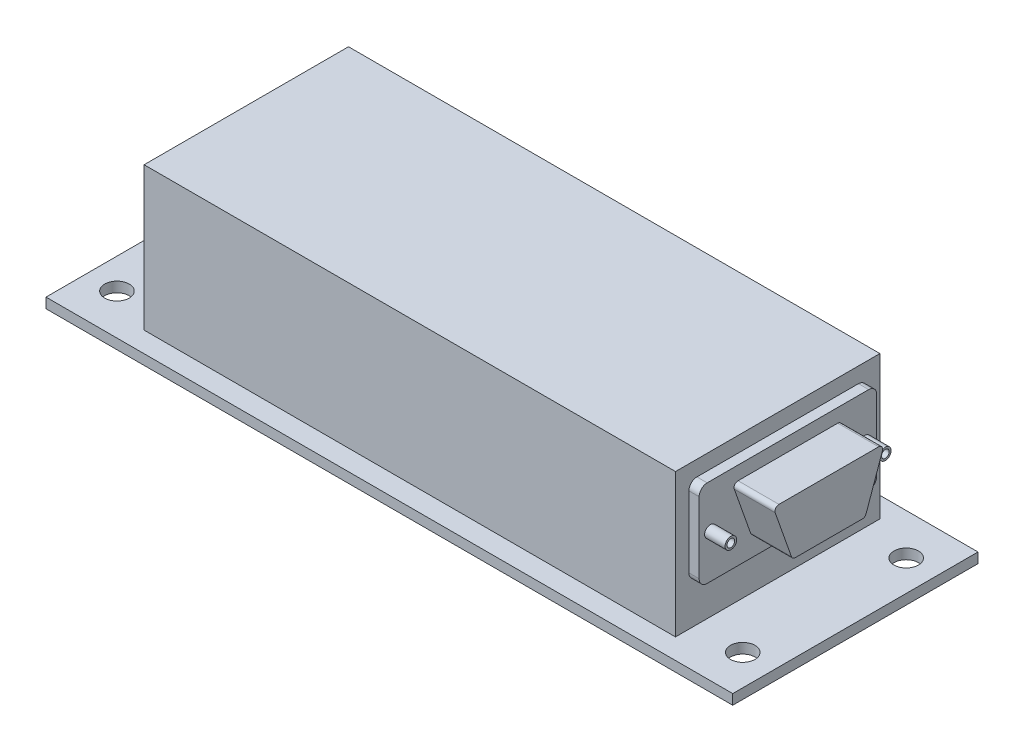
ISO-10303-21;
HEADER;
FILE_DESCRIPTION(('STEP AP214'),'2;1');
FILE_NAME('part.step','',(''),(''),'','','');
FILE_SCHEMA(('AUTOMOTIVE_DESIGN { 1 0 10303 214 1 1 1 1 }'));
ENDSEC;
DATA;
#1=APPLICATION_CONTEXT('core data for automotive mechanical design processes');
#2=APPLICATION_PROTOCOL_DEFINITION('international standard','automotive_design',2000,#1);
#3=PRODUCT_CONTEXT('',#1,'mechanical');
#4=PRODUCT('Part','Part','',(#3));
#5=PRODUCT_RELATED_PRODUCT_CATEGORY('part','',(#4));
#6=PRODUCT_DEFINITION_FORMATION('','',#4);
#7=PRODUCT_DEFINITION_CONTEXT('part definition',#1,'design');
#8=PRODUCT_DEFINITION('design','',#6,#7);
#9=PRODUCT_DEFINITION_SHAPE('','',#8);
#10=(LENGTH_UNIT() NAMED_UNIT(*) SI_UNIT(.MILLI.,.METRE.));
#11=(NAMED_UNIT(*) PLANE_ANGLE_UNIT() SI_UNIT($,.RADIAN.));
#12=(NAMED_UNIT(*) SI_UNIT($,.STERADIAN.) SOLID_ANGLE_UNIT());
#13=UNCERTAINTY_MEASURE_WITH_UNIT(LENGTH_MEASURE(1.E-05),#10,'distance_accuracy_value','');
#14=(GEOMETRIC_REPRESENTATION_CONTEXT(3) GLOBAL_UNCERTAINTY_ASSIGNED_CONTEXT((#13)) GLOBAL_UNIT_ASSIGNED_CONTEXT((#10,
#11,#12)) REPRESENTATION_CONTEXT('',''));
#15=CARTESIAN_POINT('',(0.,0.,0.));
#16=DIRECTION('',(0.,0.,1.));
#17=DIRECTION('',(1.,0.,0.));
#18=AXIS2_PLACEMENT_3D('',#15,#16,#17);
#19=CARTESIAN_POINT('',(42.8625,18.6102106849233,12.5431947926229));
#20=DIRECTION('',(-1.,0.,0.));
#21=DIRECTION('',(0.,0.,1.));
#22=AXIS2_PLACEMENT_3D('',#19,#20,#21);
#23=PLANE('',#22);
#24=CARTESIAN_POINT('',(42.8625,18.6102106849233,12.5431947926229));
#25=DIRECTION('',(-1.,0.,0.));
#26=DIRECTION('',(0.,0.,1.));
#27=AXIS2_PLACEMENT_3D('',#24,#25,#26);
#28=CIRCLE('',#27,1.25);
#29=CARTESIAN_POINT('',(42.8625,18.6102106849233,13.7931947926229));
#30=VERTEX_POINT('',#29);
#31=CARTESIAN_POINT('',(42.8625,19.8602106849233,12.5431947926229));
#32=VERTEX_POINT('',#31);
#33=EDGE_CURVE('E239',#30,#32,#28,.T.);
#34=ORIENTED_EDGE('',*,*,#33,.F.);
#35=DIRECTION('',(0.,1.,0.));
#36=VECTOR('',#35,1.);
#37=CARTESIAN_POINT('',(42.8625,7.57674864324256,13.7931947926229));
#38=LINE('',#37,#36);
#39=CARTESIAN_POINT('',(42.8625,7.57674864324256,13.7931947926229));
#40=VERTEX_POINT('',#39);
#41=EDGE_CURVE('E258',#40,#30,#38,.T.);
#42=ORIENTED_EDGE('',*,*,#41,.F.);
#43=CARTESIAN_POINT('',(42.8625,7.57674864324255,12.5431947926229));
#44=DIRECTION('',(1.,0.,0.));
#45=DIRECTION('',(0.,0.,-1.));
#46=AXIS2_PLACEMENT_3D('',#43,#44,#45);
#47=CIRCLE('',#46,1.25);
#48=CARTESIAN_POINT('',(42.8625,6.32674864324255,12.5431947926229));
#49=VERTEX_POINT('',#48);
#50=EDGE_CURVE('E256',#40,#49,#47,.T.);
#51=ORIENTED_EDGE('',*,*,#50,.T.);
#52=DIRECTION('',(0.,0.,-1.));
#53=VECTOR('',#52,1.);
#54=CARTESIAN_POINT('',(42.8625,6.32674864324255,12.5431947926229));
#55=LINE('',#54,#53);
#56=CARTESIAN_POINT('',(42.8625,6.32674864324255,-12.5431947926229));
#57=VERTEX_POINT('',#56);
#58=EDGE_CURVE('E254',#49,#57,#55,.T.);
#59=ORIENTED_EDGE('',*,*,#58,.T.);
#60=CARTESIAN_POINT('',(42.8625,7.57674864324255,-12.5431947926229));
#61=DIRECTION('',(-1.,0.,0.));
#62=DIRECTION('',(0.,0.,1.));
#63=AXIS2_PLACEMENT_3D('',#60,#61,#62);
#64=CIRCLE('',#63,1.25);
#65=CARTESIAN_POINT('',(42.8625,7.57674864324256,-13.7931947926229));
#66=VERTEX_POINT('',#65);
#67=EDGE_CURVE('E251',#66,#57,#64,.T.);
#68=ORIENTED_EDGE('',*,*,#67,.F.);
#69=DIRECTION('',(0.,1.,0.));
#70=VECTOR('',#69,1.);
#71=CARTESIAN_POINT('',(42.8625,7.57674864324256,-13.7931947926229));
#72=LINE('',#71,#70);
#73=CARTESIAN_POINT('',(42.8625,18.6102106849233,-13.7931947926229));
#74=VERTEX_POINT('',#73);
#75=EDGE_CURVE('E249',#66,#74,#72,.T.);
#76=ORIENTED_EDGE('',*,*,#75,.T.);
#77=CARTESIAN_POINT('',(42.8625,18.6102106849233,-12.5431947926229));
#78=DIRECTION('',(-1.,0.,0.));
#79=DIRECTION('',(0.,0.,1.));
#80=AXIS2_PLACEMENT_3D('',#77,#78,#79);
#81=CIRCLE('',#80,1.25);
#82=CARTESIAN_POINT('',(42.8625,19.8602106849233,-12.5431947926229));
#83=VERTEX_POINT('',#82);
#84=EDGE_CURVE('E246',#83,#74,#81,.T.);
#85=ORIENTED_EDGE('',*,*,#84,.F.);
#86=DIRECTION('',(0.,0.,-1.));
#87=VECTOR('',#86,1.);
#88=CARTESIAN_POINT('',(42.8625,19.8602106849233,12.5431947926229));
#89=LINE('',#88,#87);
#90=EDGE_CURVE('E242',#32,#83,#89,.T.);
#91=ORIENTED_EDGE('',*,*,#90,.F.);
#92=EDGE_LOOP('',(#34,#42,#51,#59,#68,#76,#85,#91));
#93=FACE_BOUND('',#92,.T.);
#94=CARTESIAN_POINT('',(42.8625,13.0934796640829,-11.9612683563152));
#95=DIRECTION('',(-1.,0.,0.));
#96=DIRECTION('',(0.,0.,1.));
#97=AXIS2_PLACEMENT_3D('',#94,#95,#96);
#98=CIRCLE('',#97,0.9);
#99=CARTESIAN_POINT('',(42.8625,13.0934796640829,-11.0612683563152));
#100=VERTEX_POINT('',#99);
#101=EDGE_CURVE('E41',#100,#100,#98,.F.);
#102=ORIENTED_EDGE('',*,*,#101,.F.);
#103=EDGE_LOOP('',(#102));
#104=FACE_BOUND('',#103,.T.);
#105=CARTESIAN_POINT('',(42.8625,13.0934796640829,12.0387316436848));
#106=DIRECTION('',(-1.,0.,0.));
#107=DIRECTION('',(0.,0.,1.));
#108=AXIS2_PLACEMENT_3D('',#105,#106,#107);
#109=CIRCLE('',#108,0.9);
#110=CARTESIAN_POINT('',(42.8625,13.0934796640829,12.9387316436848));
#111=VERTEX_POINT('',#110);
#112=EDGE_CURVE('E11',#111,#111,#109,.F.);
#113=ORIENTED_EDGE('',*,*,#112,.F.);
#114=EDGE_LOOP('',(#113));
#115=FACE_BOUND('',#114,.T.);
#116=CARTESIAN_POINT('',(42.8625,9.92592052013265,5.20764379571065));
#117=DIRECTION('',(1.,0.,0.));
#118=DIRECTION('',(0.,0.,1.));
#119=AXIS2_PLACEMENT_3D('',#116,#117,#118);
#120=CIRCLE('',#119,0.625000000000001);
#121=CARTESIAN_POINT('',(42.8625,9.71808052103222,5.79707363443103));
#122=VERTEX_POINT('',#121);
#123=CARTESIAN_POINT('',(42.8625,9.30092052013265,5.20764379571065));
#124=VERTEX_POINT('',#123);
#125=EDGE_CURVE('E214',#122,#124,#120,.T.);
#126=ORIENTED_EDGE('',*,*,#125,.F.);
#127=DIRECTION('',(0.,-0.943087741952607,-0.33254399856069));
#128=VECTOR('',#127,1.);
#129=CARTESIAN_POINT('',(42.8625,16.9065080909268,8.33179902753954));
#130=LINE('',#129,#128);
#131=CARTESIAN_POINT('',(42.8625,16.9065080909268,8.33179902753954));
#132=VERTEX_POINT('',#131);
#133=EDGE_CURVE('E211',#132,#122,#130,.T.);
#134=ORIENTED_EDGE('',*,*,#133,.F.);
#135=CARTESIAN_POINT('',(42.8625,17.1143480900272,7.74236918881916));
#136=DIRECTION('',(1.,0.,0.));
#137=DIRECTION('',(0.,0.,1.));
#138=AXIS2_PLACEMENT_3D('',#135,#136,#137);
#139=CIRCLE('',#138,0.625);
#140=CARTESIAN_POINT('',(42.8625,17.7393480900272,7.74236918881913));
#141=VERTEX_POINT('',#140);
#142=EDGE_CURVE('E410',#141,#132,#139,.T.);
#143=ORIENTED_EDGE('',*,*,#142,.F.);
#144=DIRECTION('',(0.,0.,1.));
#145=VECTOR('',#144,1.);
#146=CARTESIAN_POINT('',(42.8625,17.7393480900266,-7.74236918882591));
#147=LINE('',#146,#145);
#148=CARTESIAN_POINT('',(42.8625,17.7393480900266,-7.74236918882591));
#149=VERTEX_POINT('',#148);
#150=EDGE_CURVE('E444',#149,#141,#147,.T.);
#151=ORIENTED_EDGE('',*,*,#150,.F.);
#152=CARTESIAN_POINT('',(42.8625,17.1143480900272,-7.74236918882546));
#153=DIRECTION('',(1.,0.,0.));
#154=DIRECTION('',(0.,0.,1.));
#155=AXIS2_PLACEMENT_3D('',#152,#153,#154);
#156=CIRCLE('',#155,0.625);
#157=CARTESIAN_POINT('',(42.8625,16.9065080909264,-8.33179902754568));
#158=VERTEX_POINT('',#157);
#159=EDGE_CURVE('E438',#158,#149,#156,.T.);
#160=ORIENTED_EDGE('',*,*,#159,.F.);
#161=DIRECTION('',(0.,0.943087741952335,-0.332543998561462));
#162=VECTOR('',#161,1.);
#163=CARTESIAN_POINT('',(42.8625,9.71808052103179,-5.79707363443123));
#164=LINE('',#163,#162);
#165=CARTESIAN_POINT('',(42.8625,9.71808052103179,-5.79707363443124));
#166=VERTEX_POINT('',#165);
#167=EDGE_CURVE('E433',#166,#158,#164,.T.);
#168=ORIENTED_EDGE('',*,*,#167,.F.);
#169=CARTESIAN_POINT('',(42.8625,9.92592052013265,-5.20764379571101));
#170=DIRECTION('',(1.,0.,0.));
#171=DIRECTION('',(0.,0.,1.));
#172=AXIS2_PLACEMENT_3D('',#169,#170,#171);
#173=CIRCLE('',#172,0.625);
#174=CARTESIAN_POINT('',(42.8625,9.30092052013265,-5.207643795711));
#175=VERTEX_POINT('',#174);
#176=EDGE_CURVE('E53',#175,#166,#173,.T.);
#177=ORIENTED_EDGE('',*,*,#176,.F.);
#178=DIRECTION('',(0.,0.,-1.));
#179=VECTOR('',#178,1.);
#180=CARTESIAN_POINT('',(42.8625,9.30092052013265,5.20764379571065));
#181=LINE('',#180,#179);
#182=EDGE_CURVE('E48',#124,#175,#181,.T.);
#183=ORIENTED_EDGE('',*,*,#182,.F.);
#184=EDGE_LOOP('',(#126,#134,#143,#151,#160,#168,#177,#183));
#185=FACE_BOUND('',#184,.T.);
#186=ADVANCED_FACE('F33',(#93,#104,#115,#185),#23,.F.);
#187=CARTESIAN_POINT('',(0.,0.,0.));
#188=DIRECTION('',(0.,-1.,0.));
#189=DIRECTION('',(0.,0.,-1.));
#190=AXIS2_PLACEMENT_3D('',#187,#188,#189);
#191=PLANE('',#190);
#192=DIRECTION('',(0.,0.,1.));
#193=VECTOR('',#192,1.);
#194=CARTESIAN_POINT('',(-53.34,0.,19.05));
#195=LINE('',#194,#193);
#196=CARTESIAN_POINT('',(-53.34,0.,-19.05));
#197=VERTEX_POINT('',#196);
#198=CARTESIAN_POINT('',(-53.34,0.,19.05));
#199=VERTEX_POINT('',#198);
#200=EDGE_CURVE('E355',#197,#199,#195,.T.);
#201=ORIENTED_EDGE('',*,*,#200,.T.);
#202=DIRECTION('',(1.,0.,0.));
#203=VECTOR('',#202,1.);
#204=CARTESIAN_POINT('',(-53.34,0.,19.05));
#205=LINE('',#204,#203);
#206=CARTESIAN_POINT('',(53.34,0.,19.05));
#207=VERTEX_POINT('',#206);
#208=EDGE_CURVE('E374',#199,#207,#205,.T.);
#209=ORIENTED_EDGE('',*,*,#208,.T.);
#210=DIRECTION('',(0.,0.,-1.));
#211=VECTOR('',#210,1.);
#212=CARTESIAN_POINT('',(53.34,0.,19.05));
#213=LINE('',#212,#211);
#214=CARTESIAN_POINT('',(53.34,0.,-19.05));
#215=VERTEX_POINT('',#214);
#216=EDGE_CURVE('E377',#207,#215,#213,.T.);
#217=ORIENTED_EDGE('',*,*,#216,.T.);
#218=DIRECTION('',(-1.,0.,0.));
#219=VECTOR('',#218,1.);
#220=CARTESIAN_POINT('',(-53.34,0.,-19.05));
#221=LINE('',#220,#219);
#222=EDGE_CURVE('E362',#215,#197,#221,.T.);
#223=ORIENTED_EDGE('',*,*,#222,.T.);
#224=EDGE_LOOP('',(#201,#209,#217,#223));
#225=FACE_BOUND('',#224,.T.);
#226=CARTESIAN_POINT('',(-48.6359969579293,0.,-12.6603271121407));
#227=DIRECTION('',(0.,1.,0.));
#228=DIRECTION('',(0.,0.,1.));
#229=AXIS2_PLACEMENT_3D('',#226,#227,#228);
#230=CIRCLE('',#229,1.9);
#231=CARTESIAN_POINT('',(-48.6359969579293,0.,-10.7603271121407));
#232=VERTEX_POINT('',#231);
#233=EDGE_CURVE('E343',#232,#232,#230,.T.);
#234=ORIENTED_EDGE('',*,*,#233,.F.);
#235=EDGE_LOOP('',(#234));
#236=FACE_BOUND('',#235,.T.);
#237=CARTESIAN_POINT('',(48.5774999999967,0.,12.7313045134695));
#238=DIRECTION('',(0.,1.,0.));
#239=DIRECTION('',(0.,0.,1.));
#240=AXIS2_PLACEMENT_3D('',#237,#238,#239);
#241=CIRCLE('',#240,1.9);
#242=CARTESIAN_POINT('',(48.5774999999967,0.,14.6313045134695));
#243=VERTEX_POINT('',#242);
#244=EDGE_CURVE('E333',#243,#243,#241,.T.);
#245=ORIENTED_EDGE('',*,*,#244,.F.);
#246=EDGE_LOOP('',(#245));
#247=FACE_BOUND('',#246,.T.);
#248=CARTESIAN_POINT('',(48.5775000000035,0.,-12.6603271121407));
#249=DIRECTION('',(0.,1.,0.));
#250=DIRECTION('',(0.,0.,1.));
#251=AXIS2_PLACEMENT_3D('',#248,#249,#250);
#252=CIRCLE('',#251,1.9);
#253=CARTESIAN_POINT('',(48.5775000000035,0.,-10.7603271121407));
#254=VERTEX_POINT('',#253);
#255=EDGE_CURVE('E337',#254,#254,#252,.T.);
#256=ORIENTED_EDGE('',*,*,#255,.F.);
#257=EDGE_LOOP('',(#256));
#258=FACE_BOUND('',#257,.T.);
#259=CARTESIAN_POINT('',(-48.6359969579293,0.,12.7313045134734));
#260=DIRECTION('',(0.,1.,0.));
#261=DIRECTION('',(0.,0.,1.));
#262=AXIS2_PLACEMENT_3D('',#259,#260,#261);
#263=CIRCLE('',#262,1.9);
#264=CARTESIAN_POINT('',(-48.6359969579293,0.,14.6313045134734));
#265=VERTEX_POINT('',#264);
#266=EDGE_CURVE('E344',#265,#265,#263,.T.);
#267=ORIENTED_EDGE('',*,*,#266,.F.);
#268=EDGE_LOOP('',(#267));
#269=FACE_BOUND('',#268,.T.);
#270=DIRECTION('',(0.,0.,-1.));
#271=VECTOR('',#270,1.);
#272=CARTESIAN_POINT('',(41.275,0.,15.875));
#273=LINE('',#272,#271);
#274=CARTESIAN_POINT('',(41.275,0.,15.875));
#275=VERTEX_POINT('',#274);
#276=CARTESIAN_POINT('',(41.275,0.,-15.875));
#277=VERTEX_POINT('',#276);
#278=EDGE_CURVE('E285',#275,#277,#273,.T.);
#279=ORIENTED_EDGE('',*,*,#278,.F.);
#280=DIRECTION('',(1.,0.,0.));
#281=VECTOR('',#280,1.);
#282=CARTESIAN_POINT('',(-41.275,0.,15.875));
#283=LINE('',#282,#281);
#284=CARTESIAN_POINT('',(-41.275,0.,15.875));
#285=VERTEX_POINT('',#284);
#286=EDGE_CURVE('E305',#285,#275,#283,.T.);
#287=ORIENTED_EDGE('',*,*,#286,.F.);
#288=DIRECTION('',(0.,0.,1.));
#289=VECTOR('',#288,1.);
#290=CARTESIAN_POINT('',(-41.275,0.,15.875));
#291=LINE('',#290,#289);
#292=CARTESIAN_POINT('',(-41.275,0.,-15.875));
#293=VERTEX_POINT('',#292);
#294=EDGE_CURVE('E317',#293,#285,#291,.T.);
#295=ORIENTED_EDGE('',*,*,#294,.F.);
#296=DIRECTION('',(-1.,0.,0.));
#297=VECTOR('',#296,1.);
#298=CARTESIAN_POINT('',(-41.275,0.,-15.875));
#299=LINE('',#298,#297);
#300=EDGE_CURVE('E314',#277,#293,#299,.T.);
#301=ORIENTED_EDGE('',*,*,#300,.F.);
#302=EDGE_LOOP('',(#279,#287,#295,#301));
#303=FACE_BOUND('',#302,.T.);
#304=ADVANCED_FACE('F395',(#225,#236,#247,#258,#269,#303),#191,.F.);
#305=CARTESIAN_POINT('',(-53.34,-1.5748,19.05));
#306=DIRECTION('',(-1.,0.,0.));
#307=DIRECTION('',(0.,0.,1.));
#308=AXIS2_PLACEMENT_3D('',#305,#306,#307);
#309=PLANE('',#308);
#310=ORIENTED_EDGE('',*,*,#200,.F.);
#311=DIRECTION('',(0.,1.,0.));
#312=VECTOR('',#311,1.);
#313=CARTESIAN_POINT('',(-53.34,-1.5748,-19.05));
#314=LINE('',#313,#312);
#315=CARTESIAN_POINT('',(-53.34,-1.5748,-19.05));
#316=VERTEX_POINT('',#315);
#317=EDGE_CURVE('E382',#316,#197,#314,.T.);
#318=ORIENTED_EDGE('',*,*,#317,.F.);
#319=DIRECTION('',(0.,0.,1.));
#320=VECTOR('',#319,1.);
#321=CARTESIAN_POINT('',(-53.34,-1.5748,19.05));
#322=LINE('',#321,#320);
#323=CARTESIAN_POINT('',(-53.34,-1.5748,19.05));
#324=VERTEX_POINT('',#323);
#325=EDGE_CURVE('E358',#316,#324,#322,.T.);
#326=ORIENTED_EDGE('',*,*,#325,.T.);
#327=DIRECTION('',(0.,1.,0.));
#328=VECTOR('',#327,1.);
#329=CARTESIAN_POINT('',(-53.34,-1.5748,19.05));
#330=LINE('',#329,#328);
#331=EDGE_CURVE('E371',#324,#199,#330,.T.);
#332=ORIENTED_EDGE('',*,*,#331,.T.);
#333=EDGE_LOOP('',(#310,#318,#326,#332));
#334=FACE_BOUND('',#333,.T.);
#335=ADVANCED_FACE('F35',(#334),#309,.T.);
#336=CARTESIAN_POINT('',(-53.34,-1.5748,-19.05));
#337=DIRECTION('',(0.,0.,-1.));
#338=DIRECTION('',(-1.,0.,0.));
#339=AXIS2_PLACEMENT_3D('',#336,#337,#338);
#340=PLANE('',#339);
#341=ORIENTED_EDGE('',*,*,#222,.F.);
#342=DIRECTION('',(0.,1.,0.));
#343=VECTOR('',#342,1.);
#344=CARTESIAN_POINT('',(53.34,-1.5748,-19.05));
#345=LINE('',#344,#343);
#346=CARTESIAN_POINT('',(53.34,-1.5748,-19.05));
#347=VERTEX_POINT('',#346);
#348=EDGE_CURVE('E384',#347,#215,#345,.T.);
#349=ORIENTED_EDGE('',*,*,#348,.F.);
#350=DIRECTION('',(-1.,0.,0.));
#351=VECTOR('',#350,1.);
#352=CARTESIAN_POINT('',(-53.34,-1.5748,-19.05));
#353=LINE('',#352,#351);
#354=EDGE_CURVE('E368',#347,#316,#353,.T.);
#355=ORIENTED_EDGE('',*,*,#354,.T.);
#356=ORIENTED_EDGE('',*,*,#317,.T.);
#357=EDGE_LOOP('',(#341,#349,#355,#356));
#358=FACE_BOUND('',#357,.T.);
#359=ADVANCED_FACE('F579',(#358),#340,.T.);
#360=CARTESIAN_POINT('',(53.34,-1.5748,19.05));
#361=DIRECTION('',(1.,0.,0.));
#362=DIRECTION('',(0.,0.,-1.));
#363=AXIS2_PLACEMENT_3D('',#360,#361,#362);
#364=PLANE('',#363);
#365=ORIENTED_EDGE('',*,*,#216,.F.);
#366=DIRECTION('',(0.,1.,0.));
#367=VECTOR('',#366,1.);
#368=CARTESIAN_POINT('',(53.34,-1.5748,19.05));
#369=LINE('',#368,#367);
#370=CARTESIAN_POINT('',(53.34,-1.5748,19.05));
#371=VERTEX_POINT('',#370);
#372=EDGE_CURVE('E386',#371,#207,#369,.T.);
#373=ORIENTED_EDGE('',*,*,#372,.F.);
#374=DIRECTION('',(0.,0.,-1.));
#375=VECTOR('',#374,1.);
#376=CARTESIAN_POINT('',(53.34,-1.5748,19.05));
#377=LINE('',#376,#375);
#378=EDGE_CURVE('E365',#371,#347,#377,.T.);
#379=ORIENTED_EDGE('',*,*,#378,.T.);
#380=ORIENTED_EDGE('',*,*,#348,.T.);
#381=EDGE_LOOP('',(#365,#373,#379,#380));
#382=FACE_BOUND('',#381,.T.);
#383=ADVANCED_FACE('F582',(#382),#364,.T.);
#384=CARTESIAN_POINT('',(-53.34,-1.5748,19.05));
#385=DIRECTION('',(0.,0.,1.));
#386=DIRECTION('',(1.,0.,0.));
#387=AXIS2_PLACEMENT_3D('',#384,#385,#386);
#388=PLANE('',#387);
#389=ORIENTED_EDGE('',*,*,#208,.F.);
#390=ORIENTED_EDGE('',*,*,#331,.F.);
#391=DIRECTION('',(1.,0.,0.));
#392=VECTOR('',#391,1.);
#393=CARTESIAN_POINT('',(-53.34,-1.5748,19.05));
#394=LINE('',#393,#392);
#395=EDGE_CURVE('E361',#324,#371,#394,.T.);
#396=ORIENTED_EDGE('',*,*,#395,.T.);
#397=ORIENTED_EDGE('',*,*,#372,.T.);
#398=EDGE_LOOP('',(#389,#390,#396,#397));
#399=FACE_BOUND('',#398,.T.);
#400=ADVANCED_FACE('F574',(#399),#388,.T.);
#401=CARTESIAN_POINT('',(0.,-1.5748,0.));
#402=DIRECTION('',(0.,-1.,0.));
#403=DIRECTION('',(0.,0.,-1.));
#404=AXIS2_PLACEMENT_3D('',#401,#402,#403);
#405=PLANE('',#404);
#406=CARTESIAN_POINT('',(-48.6359969579293,-1.5748,12.7313045134734));
#407=DIRECTION('',(0.,1.,0.));
#408=DIRECTION('',(0.,0.,1.));
#409=AXIS2_PLACEMENT_3D('',#406,#407,#408);
#410=CIRCLE('',#409,1.9);
#411=CARTESIAN_POINT('',(-48.6359969579293,-1.5748,14.6313045134734));
#412=VERTEX_POINT('',#411);
#413=EDGE_CURVE('E340',#412,#412,#410,.T.);
#414=ORIENTED_EDGE('',*,*,#413,.T.);
#415=EDGE_LOOP('',(#414));
#416=FACE_BOUND('',#415,.T.);
#417=CARTESIAN_POINT('',(48.5775000000035,-1.5748,-12.6603271121407));
#418=DIRECTION('',(0.,1.,0.));
#419=DIRECTION('',(0.,0.,1.));
#420=AXIS2_PLACEMENT_3D('',#417,#418,#419);
#421=CIRCLE('',#420,1.9);
#422=CARTESIAN_POINT('',(48.5775000000035,-1.5748,-10.7603271121407));
#423=VERTEX_POINT('',#422);
#424=EDGE_CURVE('E347',#423,#423,#421,.T.);
#425=ORIENTED_EDGE('',*,*,#424,.T.);
#426=EDGE_LOOP('',(#425));
#427=FACE_BOUND('',#426,.T.);
#428=CARTESIAN_POINT('',(48.5774999999967,-1.5748,12.7313045134695));
#429=DIRECTION('',(0.,1.,0.));
#430=DIRECTION('',(0.,0.,1.));
#431=AXIS2_PLACEMENT_3D('',#428,#429,#430);
#432=CIRCLE('',#431,1.9);
#433=CARTESIAN_POINT('',(48.5774999999967,-1.5748,14.6313045134695));
#434=VERTEX_POINT('',#433);
#435=EDGE_CURVE('E334',#434,#434,#432,.T.);
#436=ORIENTED_EDGE('',*,*,#435,.T.);
#437=EDGE_LOOP('',(#436));
#438=FACE_BOUND('',#437,.T.);
#439=CARTESIAN_POINT('',(-48.6359969579293,-1.5748,-12.6603271121407));
#440=DIRECTION('',(0.,1.,0.));
#441=DIRECTION('',(0.,0.,1.));
#442=AXIS2_PLACEMENT_3D('',#439,#440,#441);
#443=CIRCLE('',#442,1.9);
#444=CARTESIAN_POINT('',(-48.6359969579293,-1.5748,-10.7603271121407));
#445=VERTEX_POINT('',#444);
#446=EDGE_CURVE('E352',#445,#445,#443,.T.);
#447=ORIENTED_EDGE('',*,*,#446,.T.);
#448=EDGE_LOOP('',(#447));
#449=FACE_BOUND('',#448,.T.);
#450=ORIENTED_EDGE('',*,*,#325,.F.);
#451=ORIENTED_EDGE('',*,*,#354,.F.);
#452=ORIENTED_EDGE('',*,*,#378,.F.);
#453=ORIENTED_EDGE('',*,*,#395,.F.);
#454=EDGE_LOOP('',(#450,#451,#452,#453));
#455=FACE_BOUND('',#454,.T.);
#456=ADVANCED_FACE('F570',(#416,#427,#438,#449,#455),#405,.T.);
#457=CARTESIAN_POINT('',(-48.6359969579293,-1.5748,-12.6603271121407));
#458=DIRECTION('',(0.,1.,0.));
#459=DIRECTION('',(0.,0.,1.));
#460=AXIS2_PLACEMENT_3D('',#457,#458,#459);
#461=CYLINDRICAL_SURFACE('',#460,1.9);
#462=ORIENTED_EDGE('',*,*,#446,.F.);
#463=EDGE_LOOP('',(#462));
#464=FACE_BOUND('',#463,.T.);
#465=ORIENTED_EDGE('',*,*,#233,.T.);
#466=EDGE_LOOP('',(#465));
#467=FACE_BOUND('',#466,.T.);
#468=ADVANCED_FACE('F560',(#464,#467),#461,.F.);
#469=CARTESIAN_POINT('',(48.5774999999967,-1.5748,12.7313045134695));
#470=DIRECTION('',(0.,1.,0.));
#471=DIRECTION('',(0.,0.,1.));
#472=AXIS2_PLACEMENT_3D('',#469,#470,#471);
#473=CYLINDRICAL_SURFACE('',#472,1.9);
#474=ORIENTED_EDGE('',*,*,#435,.F.);
#475=EDGE_LOOP('',(#474));
#476=FACE_BOUND('',#475,.T.);
#477=ORIENTED_EDGE('',*,*,#244,.T.);
#478=EDGE_LOOP('',(#477));
#479=FACE_BOUND('',#478,.T.);
#480=ADVANCED_FACE('F556',(#476,#479),#473,.F.);
#481=CARTESIAN_POINT('',(48.5775000000035,-1.5748,-12.6603271121407));
#482=DIRECTION('',(0.,1.,0.));
#483=DIRECTION('',(0.,0.,1.));
#484=AXIS2_PLACEMENT_3D('',#481,#482,#483);
#485=CYLINDRICAL_SURFACE('',#484,1.9);
#486=ORIENTED_EDGE('',*,*,#424,.F.);
#487=EDGE_LOOP('',(#486));
#488=FACE_BOUND('',#487,.T.);
#489=ORIENTED_EDGE('',*,*,#255,.T.);
#490=EDGE_LOOP('',(#489));
#491=FACE_BOUND('',#490,.T.);
#492=ADVANCED_FACE('F559',(#488,#491),#485,.F.);
#493=CARTESIAN_POINT('',(-48.6359969579293,-1.5748,12.7313045134734));
#494=DIRECTION('',(0.,1.,0.));
#495=DIRECTION('',(0.,0.,1.));
#496=AXIS2_PLACEMENT_3D('',#493,#494,#495);
#497=CYLINDRICAL_SURFACE('',#496,1.9);
#498=ORIENTED_EDGE('',*,*,#413,.F.);
#499=EDGE_LOOP('',(#498));
#500=FACE_BOUND('',#499,.T.);
#501=ORIENTED_EDGE('',*,*,#266,.T.);
#502=EDGE_LOOP('',(#501));
#503=FACE_BOUND('',#502,.T.);
#504=ADVANCED_FACE('F554',(#500,#503),#497,.F.);
#505=CARTESIAN_POINT('',(41.275,22.2504,15.875));
#506=DIRECTION('',(-1.,0.,0.));
#507=DIRECTION('',(0.,0.,1.));
#508=AXIS2_PLACEMENT_3D('',#505,#506,#507);
#509=PLANE('',#508);
#510=DIRECTION('',(0.,1.,0.));
#511=VECTOR('',#510,1.);
#512=CARTESIAN_POINT('',(41.275,7.57674864324256,13.7931947926229));
#513=LINE('',#512,#511);
#514=CARTESIAN_POINT('',(41.275,7.57674864324256,13.7931947926229));
#515=VERTEX_POINT('',#514);
#516=CARTESIAN_POINT('',(41.275,18.6102106849233,13.7931947926229));
#517=VERTEX_POINT('',#516);
#518=EDGE_CURVE('E243',#515,#517,#513,.T.);
#519=ORIENTED_EDGE('',*,*,#518,.T.);
#520=CARTESIAN_POINT('',(41.275,18.6102106849233,12.5431947926229));
#521=DIRECTION('',(-1.,0.,0.));
#522=DIRECTION('',(0.,0.,1.));
#523=AXIS2_PLACEMENT_3D('',#520,#521,#522);
#524=CIRCLE('',#523,1.25);
#525=CARTESIAN_POINT('',(41.275,19.8602106849233,12.5431947926229));
#526=VERTEX_POINT('',#525);
#527=EDGE_CURVE('E238',#517,#526,#524,.T.);
#528=ORIENTED_EDGE('',*,*,#527,.T.);
#529=DIRECTION('',(0.,0.,-1.));
#530=VECTOR('',#529,1.);
#531=CARTESIAN_POINT('',(41.275,19.8602106849233,12.5431947926229));
#532=LINE('',#531,#530);
#533=CARTESIAN_POINT('',(41.275,19.8602106849233,-12.5431947926229));
#534=VERTEX_POINT('',#533);
#535=EDGE_CURVE('E264',#526,#534,#532,.T.);
#536=ORIENTED_EDGE('',*,*,#535,.T.);
#537=CARTESIAN_POINT('',(41.275,18.6102106849233,-12.5431947926229));
#538=DIRECTION('',(-1.,0.,0.));
#539=DIRECTION('',(0.,0.,1.));
#540=AXIS2_PLACEMENT_3D('',#537,#538,#539);
#541=CIRCLE('',#540,1.25);
#542=CARTESIAN_POINT('',(41.275,18.6102106849233,-13.7931947926229));
#543=VERTEX_POINT('',#542);
#544=EDGE_CURVE('E267',#534,#543,#541,.T.);
#545=ORIENTED_EDGE('',*,*,#544,.T.);
#546=DIRECTION('',(0.,1.,0.));
#547=VECTOR('',#546,1.);
#548=CARTESIAN_POINT('',(41.275,7.57674864324256,-13.7931947926229));
#549=LINE('',#548,#547);
#550=CARTESIAN_POINT('',(41.275,7.57674864324256,-13.7931947926229));
#551=VERTEX_POINT('',#550);
#552=EDGE_CURVE('E270',#551,#543,#549,.T.);
#553=ORIENTED_EDGE('',*,*,#552,.F.);
#554=CARTESIAN_POINT('',(41.275,7.57674864324255,-12.5431947926229));
#555=DIRECTION('',(-1.,0.,0.));
#556=DIRECTION('',(0.,0.,1.));
#557=AXIS2_PLACEMENT_3D('',#554,#555,#556);
#558=CIRCLE('',#557,1.25);
#559=CARTESIAN_POINT('',(41.275,6.32674864324255,-12.5431947926229));
#560=VERTEX_POINT('',#559);
#561=EDGE_CURVE('E273',#551,#560,#558,.T.);
#562=ORIENTED_EDGE('',*,*,#561,.T.);
#563=DIRECTION('',(0.,0.,-1.));
#564=VECTOR('',#563,1.);
#565=CARTESIAN_POINT('',(41.275,6.32674864324255,12.5431947926229));
#566=LINE('',#565,#564);
#567=CARTESIAN_POINT('',(41.275,6.32674864324255,12.5431947926229));
#568=VERTEX_POINT('',#567);
#569=EDGE_CURVE('E276',#568,#560,#566,.T.);
#570=ORIENTED_EDGE('',*,*,#569,.F.);
#571=CARTESIAN_POINT('',(41.275,7.57674864324255,12.5431947926229));
#572=DIRECTION('',(1.,0.,0.));
#573=DIRECTION('',(0.,0.,-1.));
#574=AXIS2_PLACEMENT_3D('',#571,#572,#573);
#575=CIRCLE('',#574,1.25);
#576=EDGE_CURVE('E279',#515,#568,#575,.T.);
#577=ORIENTED_EDGE('',*,*,#576,.F.);
#578=EDGE_LOOP('',(#519,#528,#536,#545,#553,#562,#570,#577));
#579=FACE_BOUND('',#578,.T.);
#580=ORIENTED_EDGE('',*,*,#278,.T.);
#581=DIRECTION('',(0.,-1.,0.));
#582=VECTOR('',#581,1.);
#583=CARTESIAN_POINT('',(41.275,22.2504,-15.875));
#584=LINE('',#583,#582);
#585=CARTESIAN_POINT('',(41.275,22.2504,-15.875));
#586=VERTEX_POINT('',#585);
#587=EDGE_CURVE('E330',#586,#277,#584,.T.);
#588=ORIENTED_EDGE('',*,*,#587,.F.);
#589=DIRECTION('',(0.,0.,-1.));
#590=VECTOR('',#589,1.);
#591=CARTESIAN_POINT('',(41.275,22.2504,15.875));
#592=LINE('',#591,#590);
#593=CARTESIAN_POINT('',(41.275,22.2504,15.875));
#594=VERTEX_POINT('',#593);
#595=EDGE_CURVE('E301',#594,#586,#592,.T.);
#596=ORIENTED_EDGE('',*,*,#595,.F.);
#597=DIRECTION('',(0.,-1.,0.));
#598=VECTOR('',#597,1.);
#599=CARTESIAN_POINT('',(41.275,22.2504,15.875));
#600=LINE('',#599,#598);
#601=EDGE_CURVE('E311',#594,#275,#600,.T.);
#602=ORIENTED_EDGE('',*,*,#601,.T.);
#603=EDGE_LOOP('',(#580,#588,#596,#602));
#604=FACE_BOUND('',#603,.T.);
#605=ADVANCED_FACE('F550',(#579,#604),#509,.F.);
#606=CARTESIAN_POINT('',(-41.275,22.2504,-15.875));
#607=DIRECTION('',(0.,0.,1.));
#608=DIRECTION('',(1.,0.,0.));
#609=AXIS2_PLACEMENT_3D('',#606,#607,#608);
#610=PLANE('',#609);
#611=ORIENTED_EDGE('',*,*,#300,.T.);
#612=DIRECTION('',(0.,-1.,0.));
#613=VECTOR('',#612,1.);
#614=CARTESIAN_POINT('',(-41.275,22.2504,-15.875));
#615=LINE('',#614,#613);
#616=CARTESIAN_POINT('',(-41.275,22.2504,-15.875));
#617=VERTEX_POINT('',#616);
#618=EDGE_CURVE('E327',#617,#293,#615,.T.);
#619=ORIENTED_EDGE('',*,*,#618,.F.);
#620=DIRECTION('',(-1.,0.,0.));
#621=VECTOR('',#620,1.);
#622=CARTESIAN_POINT('',(-41.275,22.2504,-15.875));
#623=LINE('',#622,#621);
#624=EDGE_CURVE('E304',#586,#617,#623,.T.);
#625=ORIENTED_EDGE('',*,*,#624,.F.);
#626=ORIENTED_EDGE('',*,*,#587,.T.);
#627=EDGE_LOOP('',(#611,#619,#625,#626));
#628=FACE_BOUND('',#627,.T.);
#629=ADVANCED_FACE('F546',(#628),#610,.F.);
#630=CARTESIAN_POINT('',(-41.275,22.2504,15.875));
#631=DIRECTION('',(1.,0.,0.));
#632=DIRECTION('',(0.,0.,-1.));
#633=AXIS2_PLACEMENT_3D('',#630,#631,#632);
#634=PLANE('',#633);
#635=ORIENTED_EDGE('',*,*,#294,.T.);
#636=DIRECTION('',(0.,-1.,0.));
#637=VECTOR('',#636,1.);
#638=CARTESIAN_POINT('',(-41.275,22.2504,15.875));
#639=LINE('',#638,#637);
#640=CARTESIAN_POINT('',(-41.275,22.2504,15.875));
#641=VERTEX_POINT('',#640);
#642=EDGE_CURVE('E324',#641,#285,#639,.T.);
#643=ORIENTED_EDGE('',*,*,#642,.F.);
#644=DIRECTION('',(0.,0.,1.));
#645=VECTOR('',#644,1.);
#646=CARTESIAN_POINT('',(-41.275,22.2504,15.875));
#647=LINE('',#646,#645);
#648=EDGE_CURVE('E307',#617,#641,#647,.T.);
#649=ORIENTED_EDGE('',*,*,#648,.F.);
#650=ORIENTED_EDGE('',*,*,#618,.T.);
#651=EDGE_LOOP('',(#635,#643,#649,#650));
#652=FACE_BOUND('',#651,.T.);
#653=ADVANCED_FACE('F542',(#652),#634,.F.);
#654=CARTESIAN_POINT('',(-41.275,22.2504,15.875));
#655=DIRECTION('',(0.,0.,-1.));
#656=DIRECTION('',(-1.,0.,0.));
#657=AXIS2_PLACEMENT_3D('',#654,#655,#656);
#658=PLANE('',#657);
#659=ORIENTED_EDGE('',*,*,#286,.T.);
#660=ORIENTED_EDGE('',*,*,#601,.F.);
#661=DIRECTION('',(1.,0.,0.));
#662=VECTOR('',#661,1.);
#663=CARTESIAN_POINT('',(-41.275,22.2504,15.875));
#664=LINE('',#663,#662);
#665=EDGE_CURVE('E309',#641,#594,#664,.T.);
#666=ORIENTED_EDGE('',*,*,#665,.F.);
#667=ORIENTED_EDGE('',*,*,#642,.T.);
#668=EDGE_LOOP('',(#659,#660,#666,#667));
#669=FACE_BOUND('',#668,.T.);
#670=ADVANCED_FACE('F538',(#669),#658,.F.);
#671=CARTESIAN_POINT('',(0.,22.2504,0.));
#672=DIRECTION('',(0.,-1.,0.));
#673=DIRECTION('',(0.,0.,-1.));
#674=AXIS2_PLACEMENT_3D('',#671,#672,#673);
#675=PLANE('',#674);
#676=ORIENTED_EDGE('',*,*,#595,.T.);
#677=ORIENTED_EDGE('',*,*,#624,.T.);
#678=ORIENTED_EDGE('',*,*,#648,.T.);
#679=ORIENTED_EDGE('',*,*,#665,.T.);
#680=EDGE_LOOP('',(#676,#677,#678,#679));
#681=FACE_BOUND('',#680,.T.);
#682=ADVANCED_FACE('F534',(#681),#675,.F.);
#683=CARTESIAN_POINT('',(42.8625,18.6102106849233,12.5431947926229));
#684=DIRECTION('',(-1.,0.,0.));
#685=DIRECTION('',(0.,0.,1.));
#686=AXIS2_PLACEMENT_3D('',#683,#684,#685);
#687=CYLINDRICAL_SURFACE('',#686,1.25);
#688=ORIENTED_EDGE('',*,*,#527,.F.);
#689=DIRECTION('',(-1.,0.,0.));
#690=VECTOR('',#689,1.);
#691=CARTESIAN_POINT('',(42.8625,18.6102106849233,13.7931947926229));
#692=LINE('',#691,#690);
#693=EDGE_CURVE('E283',#30,#517,#692,.T.);
#694=ORIENTED_EDGE('',*,*,#693,.F.);
#695=ORIENTED_EDGE('',*,*,#33,.T.);
#696=DIRECTION('',(-1.,0.,0.));
#697=VECTOR('',#696,1.);
#698=CARTESIAN_POINT('',(42.8625,19.8602106849233,12.5431947926229));
#699=LINE('',#698,#697);
#700=EDGE_CURVE('E261',#32,#526,#699,.T.);
#701=ORIENTED_EDGE('',*,*,#700,.T.);
#702=EDGE_LOOP('',(#688,#694,#695,#701));
#703=FACE_BOUND('',#702,.T.);
#704=ADVANCED_FACE('F508',(#703),#687,.T.);
#705=CARTESIAN_POINT('',(42.8625,7.57674864324256,13.7931947926229));
#706=DIRECTION('',(0.,0.,1.));
#707=DIRECTION('',(1.,0.,0.));
#708=AXIS2_PLACEMENT_3D('',#705,#706,#707);
#709=PLANE('',#708);
#710=ORIENTED_EDGE('',*,*,#518,.F.);
#711=DIRECTION('',(-1.,0.,0.));
#712=VECTOR('',#711,1.);
#713=CARTESIAN_POINT('',(42.8625,7.57674864324256,13.7931947926229));
#714=LINE('',#713,#712);
#715=EDGE_CURVE('E286',#40,#515,#714,.T.);
#716=ORIENTED_EDGE('',*,*,#715,.F.);
#717=ORIENTED_EDGE('',*,*,#41,.T.);
#718=ORIENTED_EDGE('',*,*,#693,.T.);
#719=EDGE_LOOP('',(#710,#716,#717,#718));
#720=FACE_BOUND('',#719,.T.);
#721=ADVANCED_FACE('F504',(#720),#709,.T.);
#722=CARTESIAN_POINT('',(42.8625,7.57674864324255,12.5431947926229));
#723=DIRECTION('',(-1.,0.,0.));
#724=DIRECTION('',(0.,0.,1.));
#725=AXIS2_PLACEMENT_3D('',#722,#723,#724);
#726=CYLINDRICAL_SURFACE('',#725,1.25);
#727=ORIENTED_EDGE('',*,*,#576,.T.);
#728=DIRECTION('',(-1.,0.,0.));
#729=VECTOR('',#728,1.);
#730=CARTESIAN_POINT('',(42.8625,6.32674864324255,12.5431947926229));
#731=LINE('',#730,#729);
#732=EDGE_CURVE('E288',#49,#568,#731,.T.);
#733=ORIENTED_EDGE('',*,*,#732,.F.);
#734=ORIENTED_EDGE('',*,*,#50,.F.);
#735=ORIENTED_EDGE('',*,*,#715,.T.);
#736=EDGE_LOOP('',(#727,#733,#734,#735));
#737=FACE_BOUND('',#736,.T.);
#738=ADVANCED_FACE('F507',(#737),#726,.T.);
#739=CARTESIAN_POINT('',(42.8625,6.32674864324255,12.5431947926229));
#740=DIRECTION('',(0.,1.,0.));
#741=DIRECTION('',(0.,0.,1.));
#742=AXIS2_PLACEMENT_3D('',#739,#740,#741);
#743=PLANE('',#742);
#744=ORIENTED_EDGE('',*,*,#569,.T.);
#745=DIRECTION('',(-1.,0.,0.));
#746=VECTOR('',#745,1.);
#747=CARTESIAN_POINT('',(42.8625,6.32674864324255,-12.5431947926229));
#748=LINE('',#747,#746);
#749=EDGE_CURVE('E291',#57,#560,#748,.T.);
#750=ORIENTED_EDGE('',*,*,#749,.F.);
#751=ORIENTED_EDGE('',*,*,#58,.F.);
#752=ORIENTED_EDGE('',*,*,#732,.T.);
#753=EDGE_LOOP('',(#744,#750,#751,#752));
#754=FACE_BOUND('',#753,.T.);
#755=ADVANCED_FACE('F512',(#754),#743,.F.);
#756=CARTESIAN_POINT('',(42.8625,7.57674864324255,-12.5431947926229));
#757=DIRECTION('',(-1.,0.,0.));
#758=DIRECTION('',(0.,0.,1.));
#759=AXIS2_PLACEMENT_3D('',#756,#757,#758);
#760=CYLINDRICAL_SURFACE('',#759,1.25);
#761=ORIENTED_EDGE('',*,*,#561,.F.);
#762=DIRECTION('',(-1.,0.,0.));
#763=VECTOR('',#762,1.);
#764=CARTESIAN_POINT('',(42.8625,7.57674864324256,-13.7931947926229));
#765=LINE('',#764,#763);
#766=EDGE_CURVE('E293',#66,#551,#765,.T.);
#767=ORIENTED_EDGE('',*,*,#766,.F.);
#768=ORIENTED_EDGE('',*,*,#67,.T.);
#769=ORIENTED_EDGE('',*,*,#749,.T.);
#770=EDGE_LOOP('',(#761,#767,#768,#769));
#771=FACE_BOUND('',#770,.T.);
#772=ADVANCED_FACE('F516',(#771),#760,.T.);
#773=CARTESIAN_POINT('',(42.8625,7.57674864324256,-13.7931947926229));
#774=DIRECTION('',(0.,0.,1.));
#775=DIRECTION('',(1.,0.,0.));
#776=AXIS2_PLACEMENT_3D('',#773,#774,#775);
#777=PLANE('',#776);
#778=ORIENTED_EDGE('',*,*,#552,.T.);
#779=DIRECTION('',(-1.,0.,0.));
#780=VECTOR('',#779,1.);
#781=CARTESIAN_POINT('',(42.8625,18.6102106849233,-13.7931947926229));
#782=LINE('',#781,#780);
#783=EDGE_CURVE('E295',#74,#543,#782,.T.);
#784=ORIENTED_EDGE('',*,*,#783,.F.);
#785=ORIENTED_EDGE('',*,*,#75,.F.);
#786=ORIENTED_EDGE('',*,*,#766,.T.);
#787=EDGE_LOOP('',(#778,#784,#785,#786));
#788=FACE_BOUND('',#787,.T.);
#789=ADVANCED_FACE('F520',(#788),#777,.F.);
#790=CARTESIAN_POINT('',(42.8625,18.6102106849233,-12.5431947926229));
#791=DIRECTION('',(-1.,0.,0.));
#792=DIRECTION('',(0.,0.,1.));
#793=AXIS2_PLACEMENT_3D('',#790,#791,#792);
#794=CYLINDRICAL_SURFACE('',#793,1.25);
#795=ORIENTED_EDGE('',*,*,#544,.F.);
#796=DIRECTION('',(-1.,0.,0.));
#797=VECTOR('',#796,1.);
#798=CARTESIAN_POINT('',(42.8625,19.8602106849233,-12.5431947926229));
#799=LINE('',#798,#797);
#800=EDGE_CURVE('E297',#83,#534,#799,.T.);
#801=ORIENTED_EDGE('',*,*,#800,.F.);
#802=ORIENTED_EDGE('',*,*,#84,.T.);
#803=ORIENTED_EDGE('',*,*,#783,.T.);
#804=EDGE_LOOP('',(#795,#801,#802,#803));
#805=FACE_BOUND('',#804,.T.);
#806=ADVANCED_FACE('F524',(#805),#794,.T.);
#807=CARTESIAN_POINT('',(42.8625,19.8602106849233,12.5431947926229));
#808=DIRECTION('',(0.,1.,0.));
#809=DIRECTION('',(0.,0.,1.));
#810=AXIS2_PLACEMENT_3D('',#807,#808,#809);
#811=PLANE('',#810);
#812=ORIENTED_EDGE('',*,*,#535,.F.);
#813=ORIENTED_EDGE('',*,*,#700,.F.);
#814=ORIENTED_EDGE('',*,*,#90,.T.);
#815=ORIENTED_EDGE('',*,*,#800,.T.);
#816=EDGE_LOOP('',(#812,#813,#814,#815));
#817=FACE_BOUND('',#816,.T.);
#818=ADVANCED_FACE('F499',(#817),#811,.T.);
#819=CARTESIAN_POINT('',(46.0375,13.0934796640829,-11.9612683563152));
#820=DIRECTION('',(1.,0.,0.));
#821=DIRECTION('',(0.,0.,-1.));
#822=AXIS2_PLACEMENT_3D('',#819,#820,#821);
#823=PLANE('',#822);
#824=CARTESIAN_POINT('',(46.0375,13.0934796640829,-11.9612683563152));
#825=DIRECTION('',(1.,0.,0.));
#826=DIRECTION('',(0.,0.,-1.));
#827=AXIS2_PLACEMENT_3D('',#824,#825,#826);
#828=CIRCLE('',#827,0.9);
#829=CARTESIAN_POINT('',(46.0375,13.0934796640829,-12.8612683563152));
#830=VERTEX_POINT('',#829);
#831=EDGE_CURVE('E233',#830,#830,#828,.T.);
#832=ORIENTED_EDGE('',*,*,#831,.T.);
#833=EDGE_LOOP('',(#832));
#834=FACE_BOUND('',#833,.T.);
#835=CARTESIAN_POINT('',(46.0375,13.0934796640829,-11.9612683563152));
#836=DIRECTION('',(1.,0.,0.));
#837=DIRECTION('',(0.,0.,-1.));
#838=AXIS2_PLACEMENT_3D('',#835,#836,#837);
#839=CIRCLE('',#838,0.6);
#840=CARTESIAN_POINT('',(46.0375,13.0934796640829,-12.5612683563152));
#841=VERTEX_POINT('',#840);
#842=EDGE_CURVE('E230',#841,#841,#839,.T.);
#843=ORIENTED_EDGE('',*,*,#842,.F.);
#844=EDGE_LOOP('',(#843));
#845=FACE_BOUND('',#844,.T.);
#846=ADVANCED_FACE('F496',(#834,#845),#823,.T.);
#847=CARTESIAN_POINT('',(46.0375,13.0934796640829,-11.9612683563152));
#848=DIRECTION('',(-1.,0.,0.));
#849=DIRECTION('',(0.,0.,1.));
#850=AXIS2_PLACEMENT_3D('',#847,#848,#849);
#851=CYLINDRICAL_SURFACE('',#850,0.9);
#852=ORIENTED_EDGE('',*,*,#831,.F.);
#853=EDGE_LOOP('',(#852));
#854=FACE_BOUND('',#853,.T.);
#855=ORIENTED_EDGE('',*,*,#101,.T.);
#856=EDGE_LOOP('',(#855));
#857=FACE_BOUND('',#856,.T.);
#858=ADVANCED_FACE('F391',(#854,#857),#851,.T.);
#859=CARTESIAN_POINT('',(46.0375,13.0934796640829,-11.9612683563152));
#860=DIRECTION('',(-1.,0.,0.));
#861=DIRECTION('',(0.,0.,1.));
#862=AXIS2_PLACEMENT_3D('',#859,#860,#861);
#863=CYLINDRICAL_SURFACE('',#862,0.6);
#864=ORIENTED_EDGE('',*,*,#842,.T.);
#865=EDGE_LOOP('',(#864));
#866=FACE_BOUND('',#865,.T.);
#867=CARTESIAN_POINT('',(42.8625,13.0934796640829,-11.9612683563152));
#868=DIRECTION('',(1.,0.,0.));
#869=DIRECTION('',(0.,0.,-1.));
#870=AXIS2_PLACEMENT_3D('',#867,#868,#869);
#871=CIRCLE('',#870,0.6);
#872=CARTESIAN_POINT('',(42.8625,13.0934796640829,-12.5612683563152));
#873=VERTEX_POINT('',#872);
#874=EDGE_CURVE('E229',#873,#873,#871,.T.);
#875=ORIENTED_EDGE('',*,*,#874,.F.);
#876=EDGE_LOOP('',(#875));
#877=FACE_BOUND('',#876,.T.);
#878=ADVANCED_FACE('F492',(#866,#877),#863,.F.);
#879=ORIENTED_EDGE('',*,*,#874,.T.);
#880=EDGE_LOOP('',(#879));
#881=FACE_BOUND('',#880,.T.);
#882=ADVANCED_FACE('F399',(#881),#23,.F.);
#883=CARTESIAN_POINT('',(46.0375,13.0934796640829,12.0387316436848));
#884=DIRECTION('',(1.,0.,0.));
#885=DIRECTION('',(0.,0.,-1.));
#886=AXIS2_PLACEMENT_3D('',#883,#884,#885);
#887=PLANE('',#886);
#888=CARTESIAN_POINT('',(46.0375,13.0934796640829,12.0387316436848));
#889=DIRECTION('',(1.,0.,0.));
#890=DIRECTION('',(0.,0.,-1.));
#891=AXIS2_PLACEMENT_3D('',#888,#889,#890);
#892=CIRCLE('',#891,0.9);
#893=CARTESIAN_POINT('',(46.0375,13.0934796640829,11.1387316436848));
#894=VERTEX_POINT('',#893);
#895=EDGE_CURVE('E225',#894,#894,#892,.T.);
#896=ORIENTED_EDGE('',*,*,#895,.T.);
#897=EDGE_LOOP('',(#896));
#898=FACE_BOUND('',#897,.T.);
#899=CARTESIAN_POINT('',(46.0375,13.0934796640829,12.0387316436848));
#900=DIRECTION('',(1.,0.,0.));
#901=DIRECTION('',(0.,0.,-1.));
#902=AXIS2_PLACEMENT_3D('',#899,#900,#901);
#903=CIRCLE('',#902,0.6);
#904=CARTESIAN_POINT('',(46.0375,13.0934796640829,11.4387316436848));
#905=VERTEX_POINT('',#904);
#906=EDGE_CURVE('E218',#905,#905,#903,.T.);
#907=ORIENTED_EDGE('',*,*,#906,.F.);
#908=EDGE_LOOP('',(#907));
#909=FACE_BOUND('',#908,.T.);
#910=ADVANCED_FACE('F485',(#898,#909),#887,.T.);
#911=CARTESIAN_POINT('',(46.0375,13.0934796640829,12.0387316436848));
#912=DIRECTION('',(-1.,0.,0.));
#913=DIRECTION('',(0.,0.,1.));
#914=AXIS2_PLACEMENT_3D('',#911,#912,#913);
#915=CYLINDRICAL_SURFACE('',#914,0.9);
#916=ORIENTED_EDGE('',*,*,#895,.F.);
#917=EDGE_LOOP('',(#916));
#918=FACE_BOUND('',#917,.T.);
#919=ORIENTED_EDGE('',*,*,#112,.T.);
#920=EDGE_LOOP('',(#919));
#921=FACE_BOUND('',#920,.T.);
#922=ADVANCED_FACE('F483',(#918,#921),#915,.T.);
#923=CARTESIAN_POINT('',(46.0375,13.0934796640829,12.0387316436848));
#924=DIRECTION('',(-1.,0.,0.));
#925=DIRECTION('',(0.,0.,1.));
#926=AXIS2_PLACEMENT_3D('',#923,#924,#925);
#927=CYLINDRICAL_SURFACE('',#926,0.6);
#928=ORIENTED_EDGE('',*,*,#906,.T.);
#929=EDGE_LOOP('',(#928));
#930=FACE_BOUND('',#929,.T.);
#931=CARTESIAN_POINT('',(42.8625,13.0934796640829,12.0387316436848));
#932=DIRECTION('',(1.,0.,0.));
#933=DIRECTION('',(0.,0.,-1.));
#934=AXIS2_PLACEMENT_3D('',#931,#932,#933);
#935=CIRCLE('',#934,0.6);
#936=CARTESIAN_POINT('',(42.8625,13.0934796640829,11.4387316436848));
#937=VERTEX_POINT('',#936);
#938=EDGE_CURVE('E215',#937,#937,#935,.T.);
#939=ORIENTED_EDGE('',*,*,#938,.F.);
#940=EDGE_LOOP('',(#939));
#941=FACE_BOUND('',#940,.T.);
#942=ADVANCED_FACE('F480',(#930,#941),#927,.F.);
#943=ORIENTED_EDGE('',*,*,#938,.T.);
#944=EDGE_LOOP('',(#943));
#945=FACE_BOUND('',#944,.T.);
#946=ADVANCED_FACE('F398',(#945),#23,.F.);
#947=CARTESIAN_POINT('',(49.2125,9.92592052013265,5.20764379571065));
#948=DIRECTION('',(-1.,0.,0.));
#949=DIRECTION('',(0.,0.,1.));
#950=AXIS2_PLACEMENT_3D('',#947,#948,#949);
#951=CYLINDRICAL_SURFACE('',#950,0.625000000000001);
#952=ORIENTED_EDGE('',*,*,#125,.T.);
#953=DIRECTION('',(-1.,0.,0.));
#954=VECTOR('',#953,1.);
#955=CARTESIAN_POINT('',(49.2125,9.30092052013265,5.20764379571065));
#956=LINE('',#955,#954);
#957=CARTESIAN_POINT('',(49.2125,9.30092052013265,5.20764379571065));
#958=VERTEX_POINT('',#957);
#959=EDGE_CURVE('E195',#958,#124,#956,.T.);
#960=ORIENTED_EDGE('',*,*,#959,.F.);
#961=CARTESIAN_POINT('',(49.2125,9.92592052013265,5.20764379571065));
#962=DIRECTION('',(1.,0.,0.));
#963=DIRECTION('',(0.,0.,1.));
#964=AXIS2_PLACEMENT_3D('',#961,#962,#963);
#965=CIRCLE('',#964,0.625000000000001);
#966=CARTESIAN_POINT('',(49.2125,9.71808052103222,5.79707363443103));
#967=VERTEX_POINT('',#966);
#968=EDGE_CURVE('E202',#967,#958,#965,.T.);
#969=ORIENTED_EDGE('',*,*,#968,.F.);
#970=DIRECTION('',(-1.,0.,0.));
#971=VECTOR('',#970,1.);
#972=CARTESIAN_POINT('',(49.2125,9.71808052103222,5.79707363443103));
#973=LINE('',#972,#971);
#974=EDGE_CURVE('E407',#967,#122,#973,.T.);
#975=ORIENTED_EDGE('',*,*,#974,.T.);
#976=EDGE_LOOP('',(#952,#960,#969,#975));
#977=FACE_BOUND('',#976,.T.);
#978=ADVANCED_FACE('F213',(#977),#951,.T.);
#979=CARTESIAN_POINT('',(49.2125,9.30092052013265,5.20764379571065));
#980=DIRECTION('',(0.,1.,0.));
#981=DIRECTION('',(0.,0.,1.));
#982=AXIS2_PLACEMENT_3D('',#979,#980,#981);
#983=PLANE('',#982);
#984=ORIENTED_EDGE('',*,*,#182,.T.);
#985=DIRECTION('',(-1.,0.,0.));
#986=VECTOR('',#985,1.);
#987=CARTESIAN_POINT('',(49.2125,9.30092052013265,-5.207643795711));
#988=LINE('',#987,#986);
#989=CARTESIAN_POINT('',(49.2125,9.30092052013265,-5.207643795711));
#990=VERTEX_POINT('',#989);
#991=EDGE_CURVE('E198',#990,#175,#988,.T.);
#992=ORIENTED_EDGE('',*,*,#991,.F.);
#993=DIRECTION('',(0.,0.,-1.));
#994=VECTOR('',#993,1.);
#995=CARTESIAN_POINT('',(49.2125,9.30092052013265,5.20764379571065));
#996=LINE('',#995,#994);
#997=EDGE_CURVE('E191',#958,#990,#996,.T.);
#998=ORIENTED_EDGE('',*,*,#997,.F.);
#999=ORIENTED_EDGE('',*,*,#959,.T.);
#1000=EDGE_LOOP('',(#984,#992,#998,#999));
#1001=FACE_BOUND('',#1000,.T.);
#1002=ADVANCED_FACE('F193',(#1001),#983,.F.);
#1003=CARTESIAN_POINT('',(49.2125,9.92592052013265,-5.20764379571101));
#1004=DIRECTION('',(-1.,0.,0.));
#1005=DIRECTION('',(0.,0.,1.));
#1006=AXIS2_PLACEMENT_3D('',#1003,#1004,#1005);
#1007=CYLINDRICAL_SURFACE('',#1006,0.625);
#1008=ORIENTED_EDGE('',*,*,#176,.T.);
#1009=DIRECTION('',(-1.,0.,0.));
#1010=VECTOR('',#1009,1.);
#1011=CARTESIAN_POINT('',(49.2125,9.71808052103179,-5.79707363443124));
#1012=LINE('',#1011,#1010);
#1013=CARTESIAN_POINT('',(49.2125,9.71808052103179,-5.79707363443124));
#1014=VERTEX_POINT('',#1013);
#1015=EDGE_CURVE('E220',#1014,#166,#1012,.T.);
#1016=ORIENTED_EDGE('',*,*,#1015,.F.);
#1017=CARTESIAN_POINT('',(49.2125,9.92592052013265,-5.20764379571101));
#1018=DIRECTION('',(1.,0.,0.));
#1019=DIRECTION('',(0.,0.,1.));
#1020=AXIS2_PLACEMENT_3D('',#1017,#1018,#1019);
#1021=CIRCLE('',#1020,0.625);
#1022=EDGE_CURVE('E201',#990,#1014,#1021,.T.);
#1023=ORIENTED_EDGE('',*,*,#1022,.F.);
#1024=ORIENTED_EDGE('',*,*,#991,.T.);
#1025=EDGE_LOOP('',(#1008,#1016,#1023,#1024));
#1026=FACE_BOUND('',#1025,.T.);
#1027=ADVANCED_FACE('F436',(#1026),#1007,.T.);
#1028=CARTESIAN_POINT('',(49.2125,9.71808052103179,-5.79707363443123));
#1029=DIRECTION('',(0.,0.332543998561462,0.943087741952335));
#1030=DIRECTION('',(0.,-0.943087741952335,0.332543998561462));
#1031=AXIS2_PLACEMENT_3D('',#1028,#1029,#1030);
#1032=PLANE('',#1031);
#1033=ORIENTED_EDGE('',*,*,#167,.T.);
#1034=DIRECTION('',(-1.,0.,0.));
#1035=VECTOR('',#1034,1.);
#1036=CARTESIAN_POINT('',(49.2125,16.9065080909262,-8.33179902754629));
#1037=LINE('',#1036,#1035);
#1038=CARTESIAN_POINT('',(49.2125,16.9065080909262,-8.33179902754629));
#1039=VERTEX_POINT('',#1038);
#1040=EDGE_CURVE('E424',#1039,#158,#1037,.T.);
#1041=ORIENTED_EDGE('',*,*,#1040,.F.);
#1042=DIRECTION('',(0.,0.943087741952335,-0.332543998561462));
#1043=VECTOR('',#1042,1.);
#1044=CARTESIAN_POINT('',(49.2125,9.71808052103179,-5.79707363443123));
#1045=LINE('',#1044,#1043);
#1046=EDGE_CURVE('E434',#1014,#1039,#1045,.T.);
#1047=ORIENTED_EDGE('',*,*,#1046,.F.);
#1048=ORIENTED_EDGE('',*,*,#1015,.T.);
#1049=EDGE_LOOP('',(#1033,#1041,#1047,#1048));
#1050=FACE_BOUND('',#1049,.T.);
#1051=ADVANCED_FACE('F431',(#1050),#1032,.F.);
#1052=CARTESIAN_POINT('',(49.2125,17.1143480900272,-7.74236918882546));
#1053=DIRECTION('',(-1.,0.,0.));
#1054=DIRECTION('',(0.,0.,1.));
#1055=AXIS2_PLACEMENT_3D('',#1052,#1053,#1054);
#1056=CYLINDRICAL_SURFACE('',#1055,0.625);
#1057=ORIENTED_EDGE('',*,*,#159,.T.);
#1058=DIRECTION('',(-1.,0.,0.));
#1059=VECTOR('',#1058,1.);
#1060=CARTESIAN_POINT('',(49.2125,17.7393480900272,-7.74236918882591));
#1061=LINE('',#1060,#1059);
#1062=CARTESIAN_POINT('',(49.2125,17.7393480900272,-7.74236918882591));
#1063=VERTEX_POINT('',#1062);
#1064=EDGE_CURVE('E421',#1063,#149,#1061,.T.);
#1065=ORIENTED_EDGE('',*,*,#1064,.F.);
#1066=CARTESIAN_POINT('',(49.2125,17.1143480900272,-7.74236918882546));
#1067=DIRECTION('',(1.,0.,0.));
#1068=DIRECTION('',(0.,0.,1.));
#1069=AXIS2_PLACEMENT_3D('',#1066,#1067,#1068);
#1070=CIRCLE('',#1069,0.625);
#1071=EDGE_CURVE('E458',#1039,#1063,#1070,.T.);
#1072=ORIENTED_EDGE('',*,*,#1071,.F.);
#1073=ORIENTED_EDGE('',*,*,#1040,.T.);
#1074=EDGE_LOOP('',(#1057,#1065,#1072,#1073));
#1075=FACE_BOUND('',#1074,.T.);
#1076=ADVANCED_FACE('F457',(#1075),#1056,.T.);
#1077=CARTESIAN_POINT('',(49.2125,17.7393480900266,-7.74236918882591));
#1078=DIRECTION('',(0.,-1.,0.));
#1079=DIRECTION('',(0.,0.,-1.));
#1080=AXIS2_PLACEMENT_3D('',#1077,#1078,#1079);
#1081=PLANE('',#1080);
#1082=ORIENTED_EDGE('',*,*,#150,.T.);
#1083=DIRECTION('',(-1.,0.,0.));
#1084=VECTOR('',#1083,1.);
#1085=CARTESIAN_POINT('',(49.2125,17.7393480900272,7.74236918881913));
#1086=LINE('',#1085,#1084);
#1087=CARTESIAN_POINT('',(49.2125,17.7393480900272,7.74236918881913));
#1088=VERTEX_POINT('',#1087);
#1089=EDGE_CURVE('E413',#1088,#141,#1086,.T.);
#1090=ORIENTED_EDGE('',*,*,#1089,.F.);
#1091=DIRECTION('',(0.,0.,1.));
#1092=VECTOR('',#1091,1.);
#1093=CARTESIAN_POINT('',(49.2125,17.7393480900266,-7.74236918882591));
#1094=LINE('',#1093,#1092);
#1095=EDGE_CURVE('E454',#1063,#1088,#1094,.T.);
#1096=ORIENTED_EDGE('',*,*,#1095,.F.);
#1097=ORIENTED_EDGE('',*,*,#1064,.T.);
#1098=EDGE_LOOP('',(#1082,#1090,#1096,#1097));
#1099=FACE_BOUND('',#1098,.T.);
#1100=ADVANCED_FACE('F451',(#1099),#1081,.F.);
#1101=CARTESIAN_POINT('',(49.2125,17.1143480900272,7.74236918881916));
#1102=DIRECTION('',(-1.,0.,0.));
#1103=DIRECTION('',(0.,0.,1.));
#1104=AXIS2_PLACEMENT_3D('',#1101,#1102,#1103);
#1105=CYLINDRICAL_SURFACE('',#1104,0.625);
#1106=ORIENTED_EDGE('',*,*,#142,.T.);
#1107=DIRECTION('',(-1.,0.,0.));
#1108=VECTOR('',#1107,1.);
#1109=CARTESIAN_POINT('',(49.2125,16.9065080909268,8.33179902753954));
#1110=LINE('',#1109,#1108);
#1111=CARTESIAN_POINT('',(49.2125,16.9065080909268,8.33179902753954));
#1112=VERTEX_POINT('',#1111);
#1113=EDGE_CURVE('E409',#1112,#132,#1110,.T.);
#1114=ORIENTED_EDGE('',*,*,#1113,.F.);
#1115=CARTESIAN_POINT('',(49.2125,17.1143480900272,7.74236918881916));
#1116=DIRECTION('',(1.,0.,0.));
#1117=DIRECTION('',(0.,0.,1.));
#1118=AXIS2_PLACEMENT_3D('',#1115,#1116,#1117);
#1119=CIRCLE('',#1118,0.625);
#1120=EDGE_CURVE('E415',#1088,#1112,#1119,.T.);
#1121=ORIENTED_EDGE('',*,*,#1120,.F.);
#1122=ORIENTED_EDGE('',*,*,#1089,.T.);
#1123=EDGE_LOOP('',(#1106,#1114,#1121,#1122));
#1124=FACE_BOUND('',#1123,.T.);
#1125=ADVANCED_FACE('F447',(#1124),#1105,.T.);
#1126=CARTESIAN_POINT('',(49.2125,16.9065080909268,8.33179902753954));
#1127=DIRECTION('',(0.,0.33254399856069,-0.943087741952607));
#1128=DIRECTION('',(0.,0.943087741952607,0.33254399856069));
#1129=AXIS2_PLACEMENT_3D('',#1126,#1127,#1128);
#1130=PLANE('',#1129);
#1131=ORIENTED_EDGE('',*,*,#133,.T.);
#1132=ORIENTED_EDGE('',*,*,#974,.F.);
#1133=DIRECTION('',(0.,-0.943087741952607,-0.33254399856069));
#1134=VECTOR('',#1133,1.);
#1135=CARTESIAN_POINT('',(49.2125,16.9065080909268,8.33179902753954));
#1136=LINE('',#1135,#1134);
#1137=EDGE_CURVE('E207',#1112,#967,#1136,.T.);
#1138=ORIENTED_EDGE('',*,*,#1137,.F.);
#1139=ORIENTED_EDGE('',*,*,#1113,.T.);
#1140=EDGE_LOOP('',(#1131,#1132,#1138,#1139));
#1141=FACE_BOUND('',#1140,.T.);
#1142=ADVANCED_FACE('F406',(#1141),#1130,.F.);
#1143=CARTESIAN_POINT('',(49.2125,9.92592052013265,5.20764379571065));
#1144=DIRECTION('',(-1.,0.,0.));
#1145=DIRECTION('',(0.,0.,1.));
#1146=AXIS2_PLACEMENT_3D('',#1143,#1144,#1145);
#1147=PLANE('',#1146);
#1148=ORIENTED_EDGE('',*,*,#968,.T.);
#1149=ORIENTED_EDGE('',*,*,#997,.T.);
#1150=ORIENTED_EDGE('',*,*,#1022,.T.);
#1151=ORIENTED_EDGE('',*,*,#1046,.T.);
#1152=ORIENTED_EDGE('',*,*,#1071,.T.);
#1153=ORIENTED_EDGE('',*,*,#1095,.T.);
#1154=ORIENTED_EDGE('',*,*,#1120,.T.);
#1155=ORIENTED_EDGE('',*,*,#1137,.T.);
#1156=EDGE_LOOP('',(#1148,#1149,#1150,#1151,#1152,#1153,#1154,#1155));
#1157=FACE_BOUND('',#1156,.T.);
#1158=ADVANCED_FACE('F205',(#1157),#1147,.F.);
#1159=CLOSED_SHELL('',(#186,#304,#335,#359,#383,#400,#456,#468,#480,#492,#504,#605,#629,#653,
#670,#682,#704,#721,#738,#755,#772,#789,#806,#818,#846,#858,#878,#882,#910,#922,#942,#946,#978,
#1002,#1027,#1051,#1076,#1100,#1125,#1142,#1158));
#1160=MANIFOLD_SOLID_BREP('B2',#1159);
#1161=ADVANCED_BREP_SHAPE_REPRESENTATION('',(#18,#1160),#14);
#1162=SHAPE_DEFINITION_REPRESENTATION(#9,#1161);
ENDSEC;
END-ISO-10303-21;
